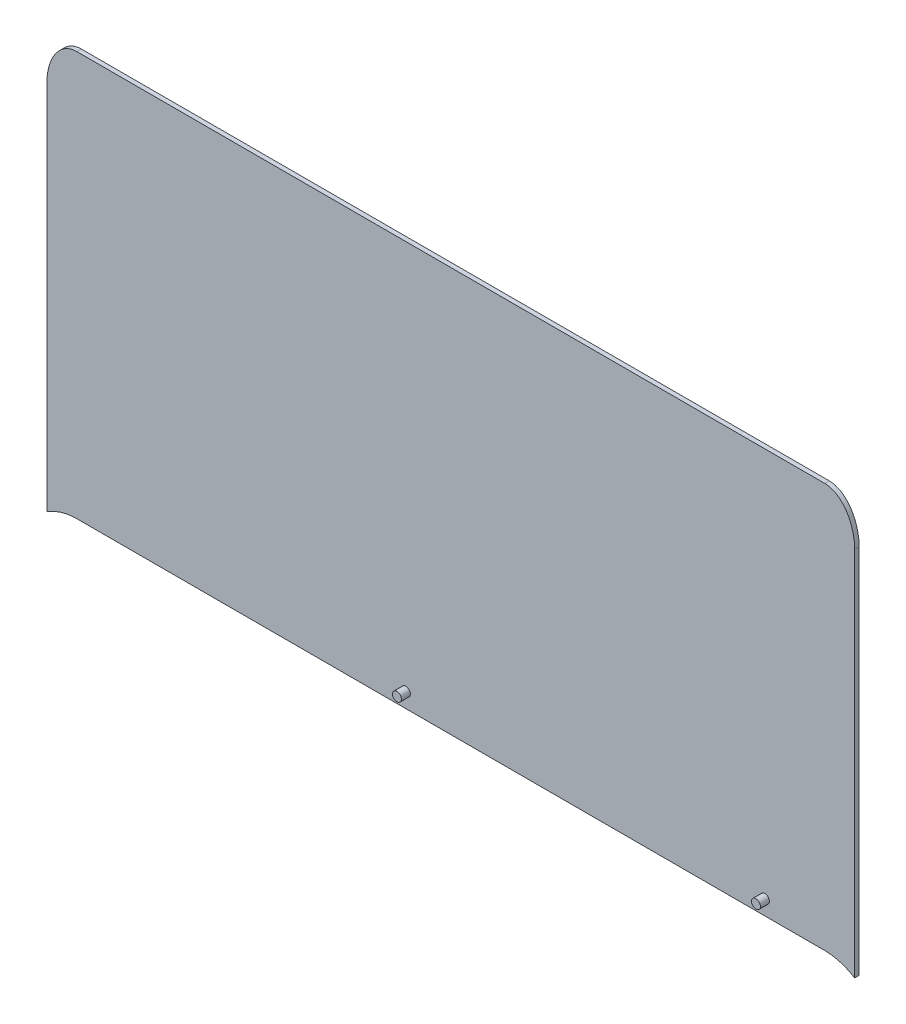
ISO-10303-21;
HEADER;
FILE_DESCRIPTION(('STEP AP214'),'2;1');
FILE_NAME('part.step','',(''),(''),'','','');
FILE_SCHEMA(('AUTOMOTIVE_DESIGN { 1 0 10303 214 1 1 1 1 }'));
ENDSEC;
DATA;
#1=APPLICATION_CONTEXT('core data for automotive mechanical design processes');
#2=APPLICATION_PROTOCOL_DEFINITION('international standard','automotive_design',2000,#1);
#3=PRODUCT_CONTEXT('',#1,'mechanical');
#4=PRODUCT('Part','Part','',(#3));
#5=PRODUCT_RELATED_PRODUCT_CATEGORY('part','',(#4));
#6=PRODUCT_DEFINITION_FORMATION('','',#4);
#7=PRODUCT_DEFINITION_CONTEXT('part definition',#1,'design');
#8=PRODUCT_DEFINITION('design','',#6,#7);
#9=PRODUCT_DEFINITION_SHAPE('','',#8);
#10=(LENGTH_UNIT() NAMED_UNIT(*) SI_UNIT(.MILLI.,.METRE.));
#11=(NAMED_UNIT(*) PLANE_ANGLE_UNIT() SI_UNIT($,.RADIAN.));
#12=(NAMED_UNIT(*) SI_UNIT($,.STERADIAN.) SOLID_ANGLE_UNIT());
#13=UNCERTAINTY_MEASURE_WITH_UNIT(LENGTH_MEASURE(1.E-05),#10,'distance_accuracy_value','');
#14=(GEOMETRIC_REPRESENTATION_CONTEXT(3) GLOBAL_UNCERTAINTY_ASSIGNED_CONTEXT((#13)) GLOBAL_UNIT_ASSIGNED_CONTEXT((#10,
#11,#12)) REPRESENTATION_CONTEXT('',''));
#15=CARTESIAN_POINT('',(0.,0.,0.));
#16=DIRECTION('',(0.,0.,1.));
#17=DIRECTION('',(1.,0.,0.));
#18=AXIS2_PLACEMENT_3D('',#15,#16,#17);
#19=CARTESIAN_POINT('',(-250.,311.498228957416,-3.));
#20=DIRECTION('',(0.,0.,-1.));
#21=DIRECTION('',(0.,1.,0.));
#22=AXIS2_PLACEMENT_3D('',#19,#20,#21);
#23=ELLIPSE('',#22,70.7106781186546,50.);
#24=DIRECTION('',(0.,0.,1.));
#25=VECTOR('',#24,1.);
#26=SURFACE_OF_LINEAR_EXTRUSION('',#23,#25);
#27=CARTESIAN_POINT('',(-250.,311.498228957416,0.));
#28=DIRECTION('',(0.,0.,-1.));
#29=DIRECTION('',(0.,1.,0.));
#30=AXIS2_PLACEMENT_3D('',#27,#28,#29);
#31=ELLIPSE('',#30,70.7106781186546,50.);
#32=CARTESIAN_POINT('',(-270.,376.305635941494,0.));
#33=VERTEX_POINT('',#32);
#34=CARTESIAN_POINT('',(-250.,382.20890707607,0.));
#35=VERTEX_POINT('',#34);
#36=EDGE_CURVE('E195',#33,#35,#31,.T.);
#37=ORIENTED_EDGE('',*,*,#36,.F.);
#38=DIRECTION('',(0.,0.,1.));
#39=VECTOR('',#38,1.);
#40=CARTESIAN_POINT('',(-270.,376.305635941494,-3.));
#41=LINE('',#40,#39);
#42=CARTESIAN_POINT('',(-270.,376.305635941494,-3.));
#43=VERTEX_POINT('',#42);
#44=EDGE_CURVE('E11',#43,#33,#41,.T.);
#45=ORIENTED_EDGE('',*,*,#44,.F.);
#46=CARTESIAN_POINT('',(-250.,382.20890707607,-3.));
#47=VERTEX_POINT('',#46);
#48=EDGE_CURVE('E183',#43,#47,#23,.T.);
#49=ORIENTED_EDGE('',*,*,#48,.T.);
#50=DIRECTION('',(0.,0.,1.));
#51=VECTOR('',#50,1.);
#52=CARTESIAN_POINT('',(-250.,382.20890707607,-3.));
#53=LINE('',#52,#51);
#54=EDGE_CURVE('E41',#47,#35,#53,.T.);
#55=ORIENTED_EDGE('',*,*,#54,.T.);
#56=EDGE_LOOP('',(#37,#45,#49,#55));
#57=FACE_BOUND('',#56,.T.);
#58=ADVANCED_FACE('F37',(#57),#26,.T.);
#59=CARTESIAN_POINT('',(-270.,624.340941432034,-3.));
#60=DIRECTION('',(-1.,0.,0.));
#61=DIRECTION('',(0.,-1.,0.));
#62=AXIS2_PLACEMENT_3D('',#59,#60,#61);
#63=PLANE('',#62);
#64=DIRECTION('',(0.,-1.,0.));
#65=VECTOR('',#64,1.);
#66=CARTESIAN_POINT('',(-270.,624.340941432034,0.));
#67=LINE('',#66,#65);
#68=CARTESIAN_POINT('',(-270.,624.340941432034,0.));
#69=VERTEX_POINT('',#68);
#70=EDGE_CURVE('E180',#69,#33,#67,.T.);
#71=ORIENTED_EDGE('',*,*,#70,.F.);
#72=DIRECTION('',(0.,0.,1.));
#73=VECTOR('',#72,1.);
#74=CARTESIAN_POINT('',(-270.,624.340941432034,-3.));
#75=LINE('',#74,#73);
#76=CARTESIAN_POINT('',(-270.,624.340941432034,-3.));
#77=VERTEX_POINT('',#76);
#78=EDGE_CURVE('E47',#77,#69,#75,.T.);
#79=ORIENTED_EDGE('',*,*,#78,.F.);
#80=DIRECTION('',(0.,-1.,0.));
#81=VECTOR('',#80,1.);
#82=CARTESIAN_POINT('',(-270.,624.340941432034,-3.));
#83=LINE('',#82,#81);
#84=EDGE_CURVE('E125',#77,#43,#83,.T.);
#85=ORIENTED_EDGE('',*,*,#84,.T.);
#86=ORIENTED_EDGE('',*,*,#44,.T.);
#87=EDGE_LOOP('',(#71,#79,#85,#86));
#88=FACE_BOUND('',#87,.T.);
#89=ADVANCED_FACE('F141',(#88),#63,.T.);
#90=CARTESIAN_POINT('',(-250.,624.340941432034,-3.));
#91=DIRECTION('',(0.,0.,1.));
#92=DIRECTION('',(0.,1.,0.));
#93=AXIS2_PLACEMENT_3D('',#90,#91,#92);
#94=ELLIPSE('',#93,28.2842712474618,20.);
#95=DIRECTION('',(0.,0.,1.));
#96=VECTOR('',#95,1.);
#97=SURFACE_OF_LINEAR_EXTRUSION('',#94,#96);
#98=CARTESIAN_POINT('',(-250.,624.340941432034,0.));
#99=DIRECTION('',(0.,0.,1.));
#100=DIRECTION('',(0.,1.,0.));
#101=AXIS2_PLACEMENT_3D('',#98,#99,#100);
#102=ELLIPSE('',#101,28.2842712474618,20.);
#103=CARTESIAN_POINT('',(-250.,652.625212679495,0.));
#104=VERTEX_POINT('',#103);
#105=EDGE_CURVE('E112',#104,#69,#102,.T.);
#106=ORIENTED_EDGE('',*,*,#105,.F.);
#107=DIRECTION('',(0.,0.,1.));
#108=VECTOR('',#107,1.);
#109=CARTESIAN_POINT('',(-250.,652.625212679495,-3.));
#110=LINE('',#109,#108);
#111=CARTESIAN_POINT('',(-250.,652.625212679495,-3.));
#112=VERTEX_POINT('',#111);
#113=EDGE_CURVE('E107',#112,#104,#110,.T.);
#114=ORIENTED_EDGE('',*,*,#113,.F.);
#115=EDGE_CURVE('E110',#112,#77,#94,.T.);
#116=ORIENTED_EDGE('',*,*,#115,.T.);
#117=ORIENTED_EDGE('',*,*,#78,.T.);
#118=EDGE_LOOP('',(#106,#114,#116,#117));
#119=FACE_BOUND('',#118,.T.);
#120=ADVANCED_FACE('F109',(#119),#97,.T.);
#121=CARTESIAN_POINT('',(250.,652.625212679496,-3.));
#122=DIRECTION('',(0.,1.,0.));
#123=DIRECTION('',(-1.,0.,0.));
#124=AXIS2_PLACEMENT_3D('',#121,#122,#123);
#125=PLANE('',#124);
#126=DIRECTION('',(-1.,0.,0.));
#127=VECTOR('',#126,1.);
#128=CARTESIAN_POINT('',(250.,652.625212679496,0.));
#129=LINE('',#128,#127);
#130=CARTESIAN_POINT('',(250.,652.625212679496,0.));
#131=VERTEX_POINT('',#130);
#132=EDGE_CURVE('E185',#131,#104,#129,.T.);
#133=ORIENTED_EDGE('',*,*,#132,.F.);
#134=DIRECTION('',(0.,0.,1.));
#135=VECTOR('',#134,1.);
#136=CARTESIAN_POINT('',(250.,652.625212679496,-3.));
#137=LINE('',#136,#135);
#138=CARTESIAN_POINT('',(250.,652.625212679496,-3.));
#139=VERTEX_POINT('',#138);
#140=EDGE_CURVE('E117',#139,#131,#137,.T.);
#141=ORIENTED_EDGE('',*,*,#140,.F.);
#142=DIRECTION('',(-1.,0.,0.));
#143=VECTOR('',#142,1.);
#144=CARTESIAN_POINT('',(250.,652.625212679496,-3.));
#145=LINE('',#144,#143);
#146=EDGE_CURVE('E123',#139,#112,#145,.T.);
#147=ORIENTED_EDGE('',*,*,#146,.T.);
#148=ORIENTED_EDGE('',*,*,#113,.T.);
#149=EDGE_LOOP('',(#133,#141,#147,#148));
#150=FACE_BOUND('',#149,.T.);
#151=ADVANCED_FACE('F127',(#150),#125,.T.);
#152=CARTESIAN_POINT('',(250.,624.340941432034,-3.));
#153=DIRECTION('',(0.,0.,1.));
#154=DIRECTION('',(0.,-1.,0.));
#155=AXIS2_PLACEMENT_3D('',#152,#153,#154);
#156=ELLIPSE('',#155,28.2842712474618,20.);
#157=DIRECTION('',(0.,0.,1.));
#158=VECTOR('',#157,1.);
#159=SURFACE_OF_LINEAR_EXTRUSION('',#156,#158);
#160=CARTESIAN_POINT('',(250.,624.340941432034,0.));
#161=DIRECTION('',(0.,0.,1.));
#162=DIRECTION('',(0.,-1.,0.));
#163=AXIS2_PLACEMENT_3D('',#160,#161,#162);
#164=ELLIPSE('',#163,28.2842712474618,20.);
#165=CARTESIAN_POINT('',(270.,624.340941432034,0.));
#166=VERTEX_POINT('',#165);
#167=EDGE_CURVE('E187',#166,#131,#164,.T.);
#168=ORIENTED_EDGE('',*,*,#167,.F.);
#169=DIRECTION('',(0.,0.,1.));
#170=VECTOR('',#169,1.);
#171=CARTESIAN_POINT('',(270.,624.340941432034,-3.));
#172=LINE('',#171,#170);
#173=CARTESIAN_POINT('',(270.,624.340941432034,-3.));
#174=VERTEX_POINT('',#173);
#175=EDGE_CURVE('E166',#174,#166,#172,.T.);
#176=ORIENTED_EDGE('',*,*,#175,.F.);
#177=EDGE_CURVE('E128',#174,#139,#156,.T.);
#178=ORIENTED_EDGE('',*,*,#177,.T.);
#179=ORIENTED_EDGE('',*,*,#140,.T.);
#180=EDGE_LOOP('',(#168,#176,#178,#179));
#181=FACE_BOUND('',#180,.T.);
#182=ADVANCED_FACE('F145',(#181),#159,.T.);
#183=CARTESIAN_POINT('',(270.,376.305635941494,-3.));
#184=DIRECTION('',(1.,0.,0.));
#185=DIRECTION('',(0.,0.,-1.));
#186=AXIS2_PLACEMENT_3D('',#183,#184,#185);
#187=PLANE('',#186);
#188=DIRECTION('',(0.,1.,0.));
#189=VECTOR('',#188,1.);
#190=CARTESIAN_POINT('',(270.,376.305635941494,0.));
#191=LINE('',#190,#189);
#192=CARTESIAN_POINT('',(270.,376.305635941494,0.));
#193=VERTEX_POINT('',#192);
#194=EDGE_CURVE('E190',#193,#166,#191,.T.);
#195=ORIENTED_EDGE('',*,*,#194,.F.);
#196=DIRECTION('',(0.,0.,1.));
#197=VECTOR('',#196,1.);
#198=CARTESIAN_POINT('',(270.,376.305635941494,-3.));
#199=LINE('',#198,#197);
#200=CARTESIAN_POINT('',(270.,376.305635941494,-3.));
#201=VERTEX_POINT('',#200);
#202=EDGE_CURVE('E168',#201,#193,#199,.T.);
#203=ORIENTED_EDGE('',*,*,#202,.F.);
#204=DIRECTION('',(0.,1.,0.));
#205=VECTOR('',#204,1.);
#206=CARTESIAN_POINT('',(270.,376.305635941494,-3.));
#207=LINE('',#206,#205);
#208=EDGE_CURVE('E130',#201,#174,#207,.T.);
#209=ORIENTED_EDGE('',*,*,#208,.T.);
#210=ORIENTED_EDGE('',*,*,#175,.T.);
#211=EDGE_LOOP('',(#195,#203,#209,#210));
#212=FACE_BOUND('',#211,.T.);
#213=ADVANCED_FACE('F148',(#212),#187,.T.);
#214=CARTESIAN_POINT('',(250.,311.498228957416,-3.));
#215=DIRECTION('',(0.,0.,-1.));
#216=DIRECTION('',(0.,-1.,0.));
#217=AXIS2_PLACEMENT_3D('',#214,#215,#216);
#218=ELLIPSE('',#217,70.7106781186546,50.);
#219=DIRECTION('',(0.,0.,1.));
#220=VECTOR('',#219,1.);
#221=SURFACE_OF_LINEAR_EXTRUSION('',#218,#220);
#222=CARTESIAN_POINT('',(250.,311.498228957416,0.));
#223=DIRECTION('',(0.,0.,-1.));
#224=DIRECTION('',(0.,-1.,0.));
#225=AXIS2_PLACEMENT_3D('',#222,#223,#224);
#226=ELLIPSE('',#225,70.7106781186546,50.);
#227=CARTESIAN_POINT('',(250.,382.20890707607,0.));
#228=VERTEX_POINT('',#227);
#229=EDGE_CURVE('E173',#228,#193,#226,.T.);
#230=ORIENTED_EDGE('',*,*,#229,.F.);
#231=DIRECTION('',(0.,0.,1.));
#232=VECTOR('',#231,1.);
#233=CARTESIAN_POINT('',(250.,382.20890707607,-3.));
#234=LINE('',#233,#232);
#235=CARTESIAN_POINT('',(250.,382.20890707607,-3.));
#236=VERTEX_POINT('',#235);
#237=EDGE_CURVE('E171',#236,#228,#234,.T.);
#238=ORIENTED_EDGE('',*,*,#237,.F.);
#239=EDGE_CURVE('E158',#236,#201,#218,.T.);
#240=ORIENTED_EDGE('',*,*,#239,.T.);
#241=ORIENTED_EDGE('',*,*,#202,.T.);
#242=EDGE_LOOP('',(#230,#238,#240,#241));
#243=FACE_BOUND('',#242,.T.);
#244=ADVANCED_FACE('F152',(#243),#221,.T.);
#245=CARTESIAN_POINT('',(250.,382.20890707607,-3.));
#246=DIRECTION('',(0.,-1.,0.));
#247=DIRECTION('',(0.,0.,-1.));
#248=AXIS2_PLACEMENT_3D('',#245,#246,#247);
#249=PLANE('',#248);
#250=DIRECTION('',(1.,0.,0.));
#251=VECTOR('',#250,1.);
#252=CARTESIAN_POINT('',(250.,382.20890707607,0.));
#253=LINE('',#252,#251);
#254=EDGE_CURVE('E194',#35,#228,#253,.T.);
#255=ORIENTED_EDGE('',*,*,#254,.F.);
#256=ORIENTED_EDGE('',*,*,#54,.F.);
#257=DIRECTION('',(1.,0.,0.));
#258=VECTOR('',#257,1.);
#259=CARTESIAN_POINT('',(250.,382.20890707607,-3.));
#260=LINE('',#259,#258);
#261=EDGE_CURVE('E162',#47,#236,#260,.T.);
#262=ORIENTED_EDGE('',*,*,#261,.T.);
#263=ORIENTED_EDGE('',*,*,#237,.T.);
#264=EDGE_LOOP('',(#255,#256,#262,#263));
#265=FACE_BOUND('',#264,.T.);
#266=ADVANCED_FACE('F156',(#265),#249,.T.);
#267=CARTESIAN_POINT('',(-250.,311.498228957416,-3.));
#268=DIRECTION('',(0.,0.,1.));
#269=DIRECTION('',(1.,0.,0.));
#270=AXIS2_PLACEMENT_3D('',#267,#268,#269);
#271=PLANE('',#270);
#272=ORIENTED_EDGE('',*,*,#48,.F.);
#273=ORIENTED_EDGE('',*,*,#84,.F.);
#274=ORIENTED_EDGE('',*,*,#115,.F.);
#275=ORIENTED_EDGE('',*,*,#146,.F.);
#276=ORIENTED_EDGE('',*,*,#177,.F.);
#277=ORIENTED_EDGE('',*,*,#208,.F.);
#278=ORIENTED_EDGE('',*,*,#239,.F.);
#279=ORIENTED_EDGE('',*,*,#261,.F.);
#280=EDGE_LOOP('',(#272,#273,#274,#275,#276,#277,#278,#279));
#281=FACE_BOUND('',#280,.T.);
#282=ADVANCED_FACE('F121',(#281),#271,.F.);
#283=CARTESIAN_POINT('',(-250.,311.498228957416,0.));
#284=DIRECTION('',(0.,0.,1.));
#285=DIRECTION('',(1.,0.,0.));
#286=AXIS2_PLACEMENT_3D('',#283,#284,#285);
#287=PLANE('',#286);
#288=CARTESIAN_POINT('',(210.,392.20890707607,0.));
#289=DIRECTION('',(0.,0.,1.));
#290=DIRECTION('',(1.,0.,0.));
#291=AXIS2_PLACEMENT_3D('',#288,#289,#290);
#292=CIRCLE('',#291,2.99999999999999);
#293=CARTESIAN_POINT('',(213.,392.20890707607,0.));
#294=VERTEX_POINT('',#293);
#295=EDGE_CURVE('E208',#294,#294,#292,.T.);
#296=ORIENTED_EDGE('',*,*,#295,.F.);
#297=EDGE_LOOP('',(#296));
#298=FACE_BOUND('',#297,.T.);
#299=CARTESIAN_POINT('',(-30.,392.20890707607,0.));
#300=DIRECTION('',(0.,0.,1.));
#301=DIRECTION('',(1.,0.,0.));
#302=AXIS2_PLACEMENT_3D('',#299,#300,#301);
#303=CIRCLE('',#302,3.00000000000001);
#304=CARTESIAN_POINT('',(-27.,392.20890707607,0.));
#305=VERTEX_POINT('',#304);
#306=EDGE_CURVE('E200',#305,#305,#303,.T.);
#307=ORIENTED_EDGE('',*,*,#306,.F.);
#308=EDGE_LOOP('',(#307));
#309=FACE_BOUND('',#308,.T.);
#310=ORIENTED_EDGE('',*,*,#36,.T.);
#311=ORIENTED_EDGE('',*,*,#254,.T.);
#312=ORIENTED_EDGE('',*,*,#229,.T.);
#313=ORIENTED_EDGE('',*,*,#194,.T.);
#314=ORIENTED_EDGE('',*,*,#167,.T.);
#315=ORIENTED_EDGE('',*,*,#132,.T.);
#316=ORIENTED_EDGE('',*,*,#105,.T.);
#317=ORIENTED_EDGE('',*,*,#70,.T.);
#318=EDGE_LOOP('',(#310,#311,#312,#313,#314,#315,#316,#317));
#319=FACE_BOUND('',#318,.T.);
#320=ADVANCED_FACE('F211',(#298,#309,#319),#287,.T.);
#321=CARTESIAN_POINT('',(-30.,392.20890707607,6.));
#322=DIRECTION('',(0.,0.,-1.));
#323=DIRECTION('',(-1.,0.,0.));
#324=AXIS2_PLACEMENT_3D('',#321,#322,#323);
#325=CYLINDRICAL_SURFACE('',#324,3.00000000000001);
#326=CARTESIAN_POINT('',(-30.,392.20890707607,6.));
#327=DIRECTION('',(0.,0.,1.));
#328=DIRECTION('',(1.,0.,0.));
#329=AXIS2_PLACEMENT_3D('',#326,#327,#328);
#330=CIRCLE('',#329,3.00000000000001);
#331=CARTESIAN_POINT('',(-27.,392.20890707607,6.));
#332=VERTEX_POINT('',#331);
#333=EDGE_CURVE('E197',#332,#332,#330,.T.);
#334=ORIENTED_EDGE('',*,*,#333,.F.);
#335=EDGE_LOOP('',(#334));
#336=FACE_BOUND('',#335,.T.);
#337=ORIENTED_EDGE('',*,*,#306,.T.);
#338=EDGE_LOOP('',(#337));
#339=FACE_BOUND('',#338,.T.);
#340=ADVANCED_FACE('F213',(#336,#339),#325,.T.);
#341=CARTESIAN_POINT('',(-30.,392.20890707607,6.));
#342=DIRECTION('',(0.,0.,1.));
#343=DIRECTION('',(1.,0.,0.));
#344=AXIS2_PLACEMENT_3D('',#341,#342,#343);
#345=PLANE('',#344);
#346=ORIENTED_EDGE('',*,*,#333,.T.);
#347=EDGE_LOOP('',(#346));
#348=FACE_BOUND('',#347,.T.);
#349=ADVANCED_FACE('F219',(#348),#345,.T.);
#350=CARTESIAN_POINT('',(210.,392.20890707607,6.));
#351=DIRECTION('',(0.,0.,-1.));
#352=DIRECTION('',(-1.,0.,0.));
#353=AXIS2_PLACEMENT_3D('',#350,#351,#352);
#354=CYLINDRICAL_SURFACE('',#353,2.99999999999999);
#355=CARTESIAN_POINT('',(210.,392.20890707607,6.));
#356=DIRECTION('',(0.,0.,1.));
#357=DIRECTION('',(1.,0.,0.));
#358=AXIS2_PLACEMENT_3D('',#355,#356,#357);
#359=CIRCLE('',#358,2.99999999999999);
#360=CARTESIAN_POINT('',(213.,392.20890707607,6.));
#361=VERTEX_POINT('',#360);
#362=EDGE_CURVE('E205',#361,#361,#359,.T.);
#363=ORIENTED_EDGE('',*,*,#362,.F.);
#364=EDGE_LOOP('',(#363));
#365=FACE_BOUND('',#364,.T.);
#366=ORIENTED_EDGE('',*,*,#295,.T.);
#367=EDGE_LOOP('',(#366));
#368=FACE_BOUND('',#367,.T.);
#369=ADVANCED_FACE('F279',(#365,#368),#354,.T.);
#370=CARTESIAN_POINT('',(210.,392.20890707607,6.));
#371=DIRECTION('',(0.,0.,1.));
#372=DIRECTION('',(1.,0.,0.));
#373=AXIS2_PLACEMENT_3D('',#370,#371,#372);
#374=PLANE('',#373);
#375=ORIENTED_EDGE('',*,*,#362,.T.);
#376=EDGE_LOOP('',(#375));
#377=FACE_BOUND('',#376,.T.);
#378=ADVANCED_FACE('F288',(#377),#374,.T.);
#379=CLOSED_SHELL('',(#58,#89,#120,#151,#182,#213,#244,#266,#282,#320,#340,#349,#369,#378));
#380=MANIFOLD_SOLID_BREP('B2',#379);
#381=ADVANCED_BREP_SHAPE_REPRESENTATION('',(#18,#380),#14);
#382=SHAPE_DEFINITION_REPRESENTATION(#9,#381);
ENDSEC;
END-ISO-10303-21;
